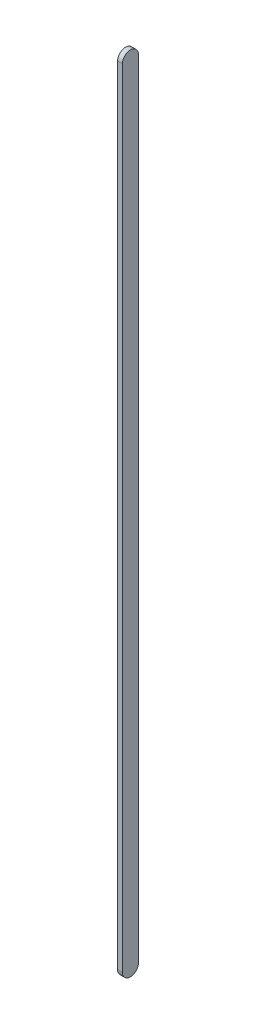
ISO-10303-21;
HEADER;
FILE_DESCRIPTION(('STEP AP214'),'2;1');
FILE_NAME('part.step','',(''),(''),'','','');
FILE_SCHEMA(('AUTOMOTIVE_DESIGN { 1 0 10303 214 1 1 1 1 }'));
ENDSEC;
DATA;
#1=APPLICATION_CONTEXT('core data for automotive mechanical design processes');
#2=APPLICATION_PROTOCOL_DEFINITION('international standard','automotive_design',2000,#1);
#3=PRODUCT_CONTEXT('',#1,'mechanical');
#4=PRODUCT('Part','Part','',(#3));
#5=PRODUCT_RELATED_PRODUCT_CATEGORY('part','',(#4));
#6=PRODUCT_DEFINITION_FORMATION('','',#4);
#7=PRODUCT_DEFINITION_CONTEXT('part definition',#1,'design');
#8=PRODUCT_DEFINITION('design','',#6,#7);
#9=PRODUCT_DEFINITION_SHAPE('','',#8);
#10=(LENGTH_UNIT() NAMED_UNIT(*) SI_UNIT(.MILLI.,.METRE.));
#11=(NAMED_UNIT(*) PLANE_ANGLE_UNIT() SI_UNIT($,.RADIAN.));
#12=(NAMED_UNIT(*) SI_UNIT($,.STERADIAN.) SOLID_ANGLE_UNIT());
#13=UNCERTAINTY_MEASURE_WITH_UNIT(LENGTH_MEASURE(1.E-05),#10,'distance_accuracy_value','');
#14=(GEOMETRIC_REPRESENTATION_CONTEXT(3) GLOBAL_UNCERTAINTY_ASSIGNED_CONTEXT((#13)) GLOBAL_UNIT_ASSIGNED_CONTEXT((#10,
#11,#12)) REPRESENTATION_CONTEXT('',''));
#15=CARTESIAN_POINT('',(0.,0.,0.));
#16=DIRECTION('',(0.,0.,1.));
#17=DIRECTION('',(1.,0.,0.));
#18=AXIS2_PLACEMENT_3D('',#15,#16,#17);
#19=CARTESIAN_POINT('',(3.,-490.,0.));
#20=DIRECTION('',(-1.,0.,0.));
#21=DIRECTION('',(0.,0.,1.));
#22=AXIS2_PLACEMENT_3D('',#19,#20,#21);
#23=CYLINDRICAL_SURFACE('',#22,5.);
#24=CARTESIAN_POINT('',(0.,-490.,0.));
#25=DIRECTION('',(1.,0.,0.));
#26=DIRECTION('',(0.,0.,-1.));
#27=AXIS2_PLACEMENT_3D('',#24,#25,#26);
#28=CIRCLE('',#27,5.);
#29=CARTESIAN_POINT('',(0.,-490.,5.));
#30=VERTEX_POINT('',#29);
#31=CARTESIAN_POINT('',(0.,-490.,-5.));
#32=VERTEX_POINT('',#31);
#33=EDGE_CURVE('E100',#30,#32,#28,.T.);
#34=ORIENTED_EDGE('',*,*,#33,.T.);
#35=DIRECTION('',(-1.,0.,0.));
#36=VECTOR('',#35,1.);
#37=CARTESIAN_POINT('',(3.,-490.,-5.));
#38=LINE('',#37,#36);
#39=CARTESIAN_POINT('',(3.,-490.,-5.));
#40=VERTEX_POINT('',#39);
#41=EDGE_CURVE('E11',#40,#32,#38,.T.);
#42=ORIENTED_EDGE('',*,*,#41,.F.);
#43=CARTESIAN_POINT('',(3.,-490.,0.));
#44=DIRECTION('',(1.,0.,0.));
#45=DIRECTION('',(0.,0.,-1.));
#46=AXIS2_PLACEMENT_3D('',#43,#44,#45);
#47=CIRCLE('',#46,5.);
#48=CARTESIAN_POINT('',(3.,-490.,5.));
#49=VERTEX_POINT('',#48);
#50=EDGE_CURVE('E86',#49,#40,#47,.T.);
#51=ORIENTED_EDGE('',*,*,#50,.F.);
#52=DIRECTION('',(-1.,0.,0.));
#53=VECTOR('',#52,1.);
#54=CARTESIAN_POINT('',(3.,-490.,5.));
#55=LINE('',#54,#53);
#56=EDGE_CURVE('E53',#49,#30,#55,.T.);
#57=ORIENTED_EDGE('',*,*,#56,.T.);
#58=EDGE_LOOP('',(#34,#42,#51,#57));
#59=FACE_BOUND('',#58,.T.);
#60=ADVANCED_FACE('F37',(#59),#23,.T.);
#61=CARTESIAN_POINT('',(3.,-490.,-5.));
#62=DIRECTION('',(0.,0.,1.));
#63=DIRECTION('',(1.,0.,0.));
#64=AXIS2_PLACEMENT_3D('',#61,#62,#63);
#65=PLANE('',#64);
#66=DIRECTION('',(0.,1.,0.));
#67=VECTOR('',#66,1.);
#68=CARTESIAN_POINT('',(0.,-490.,-5.));
#69=LINE('',#68,#67);
#70=CARTESIAN_POINT('',(0.,0.,-5.));
#71=VERTEX_POINT('',#70);
#72=EDGE_CURVE('E91',#32,#71,#69,.T.);
#73=ORIENTED_EDGE('',*,*,#72,.T.);
#74=DIRECTION('',(-1.,0.,0.));
#75=VECTOR('',#74,1.);
#76=CARTESIAN_POINT('',(3.,0.,-5.));
#77=LINE('',#76,#75);
#78=CARTESIAN_POINT('',(3.,0.,-5.));
#79=VERTEX_POINT('',#78);
#80=EDGE_CURVE('E45',#79,#71,#77,.T.);
#81=ORIENTED_EDGE('',*,*,#80,.F.);
#82=DIRECTION('',(0.,1.,0.));
#83=VECTOR('',#82,1.);
#84=CARTESIAN_POINT('',(3.,-490.,-5.));
#85=LINE('',#84,#83);
#86=EDGE_CURVE('E79',#40,#79,#85,.T.);
#87=ORIENTED_EDGE('',*,*,#86,.F.);
#88=ORIENTED_EDGE('',*,*,#41,.T.);
#89=EDGE_LOOP('',(#73,#81,#87,#88));
#90=FACE_BOUND('',#89,.T.);
#91=ADVANCED_FACE('F90',(#90),#65,.F.);
#92=CARTESIAN_POINT('',(3.,0.,0.));
#93=DIRECTION('',(-1.,0.,0.));
#94=DIRECTION('',(0.,0.,1.));
#95=AXIS2_PLACEMENT_3D('',#92,#93,#94);
#96=CYLINDRICAL_SURFACE('',#95,5.);
#97=CARTESIAN_POINT('',(0.,0.,0.));
#98=DIRECTION('',(1.,0.,0.));
#99=DIRECTION('',(0.,0.,-1.));
#100=AXIS2_PLACEMENT_3D('',#97,#98,#99);
#101=CIRCLE('',#100,5.);
#102=CARTESIAN_POINT('',(0.,0.,5.));
#103=VERTEX_POINT('',#102);
#104=EDGE_CURVE('E103',#71,#103,#101,.T.);
#105=ORIENTED_EDGE('',*,*,#104,.T.);
#106=DIRECTION('',(-1.,0.,0.));
#107=VECTOR('',#106,1.);
#108=CARTESIAN_POINT('',(3.,0.,5.));
#109=LINE('',#108,#107);
#110=CARTESIAN_POINT('',(3.,0.,5.));
#111=VERTEX_POINT('',#110);
#112=EDGE_CURVE('E68',#111,#103,#109,.T.);
#113=ORIENTED_EDGE('',*,*,#112,.F.);
#114=CARTESIAN_POINT('',(3.,0.,0.));
#115=DIRECTION('',(1.,0.,0.));
#116=DIRECTION('',(0.,0.,-1.));
#117=AXIS2_PLACEMENT_3D('',#114,#115,#116);
#118=CIRCLE('',#117,5.);
#119=EDGE_CURVE('E85',#79,#111,#118,.T.);
#120=ORIENTED_EDGE('',*,*,#119,.F.);
#121=ORIENTED_EDGE('',*,*,#80,.T.);
#122=EDGE_LOOP('',(#105,#113,#120,#121));
#123=FACE_BOUND('',#122,.T.);
#124=ADVANCED_FACE('F94',(#123),#96,.T.);
#125=CARTESIAN_POINT('',(3.,-490.,5.));
#126=DIRECTION('',(0.,0.,1.));
#127=DIRECTION('',(1.,0.,0.));
#128=AXIS2_PLACEMENT_3D('',#125,#126,#127);
#129=PLANE('',#128);
#130=DIRECTION('',(0.,1.,0.));
#131=VECTOR('',#130,1.);
#132=CARTESIAN_POINT('',(0.,-490.,5.));
#133=LINE('',#132,#131);
#134=EDGE_CURVE('E105',#30,#103,#133,.T.);
#135=ORIENTED_EDGE('',*,*,#134,.F.);
#136=ORIENTED_EDGE('',*,*,#56,.F.);
#137=DIRECTION('',(0.,1.,0.));
#138=VECTOR('',#137,1.);
#139=CARTESIAN_POINT('',(3.,-490.,5.));
#140=LINE('',#139,#138);
#141=EDGE_CURVE('E95',#49,#111,#140,.T.);
#142=ORIENTED_EDGE('',*,*,#141,.T.);
#143=ORIENTED_EDGE('',*,*,#112,.T.);
#144=EDGE_LOOP('',(#135,#136,#142,#143));
#145=FACE_BOUND('',#144,.T.);
#146=ADVANCED_FACE('F111',(#145),#129,.T.);
#147=CARTESIAN_POINT('',(3.,-490.,0.));
#148=DIRECTION('',(1.,0.,0.));
#149=DIRECTION('',(0.,0.,-1.));
#150=AXIS2_PLACEMENT_3D('',#147,#148,#149);
#151=PLANE('',#150);
#152=ORIENTED_EDGE('',*,*,#50,.T.);
#153=ORIENTED_EDGE('',*,*,#86,.T.);
#154=ORIENTED_EDGE('',*,*,#119,.T.);
#155=ORIENTED_EDGE('',*,*,#141,.F.);
#156=EDGE_LOOP('',(#152,#153,#154,#155));
#157=FACE_BOUND('',#156,.T.);
#158=ADVANCED_FACE('F82',(#157),#151,.T.);
#159=CARTESIAN_POINT('',(0.,-490.,0.));
#160=DIRECTION('',(1.,0.,0.));
#161=DIRECTION('',(0.,0.,-1.));
#162=AXIS2_PLACEMENT_3D('',#159,#160,#161);
#163=PLANE('',#162);
#164=ORIENTED_EDGE('',*,*,#33,.F.);
#165=ORIENTED_EDGE('',*,*,#134,.T.);
#166=ORIENTED_EDGE('',*,*,#104,.F.);
#167=ORIENTED_EDGE('',*,*,#72,.F.);
#168=EDGE_LOOP('',(#164,#165,#166,#167));
#169=FACE_BOUND('',#168,.T.);
#170=ADVANCED_FACE('F110',(#169),#163,.F.);
#171=CLOSED_SHELL('',(#60,#91,#124,#146,#158,#170));
#172=MANIFOLD_SOLID_BREP('B2',#171);
#173=ADVANCED_BREP_SHAPE_REPRESENTATION('',(#18,#172),#14);
#174=SHAPE_DEFINITION_REPRESENTATION(#9,#173);
ENDSEC;
END-ISO-10303-21;
